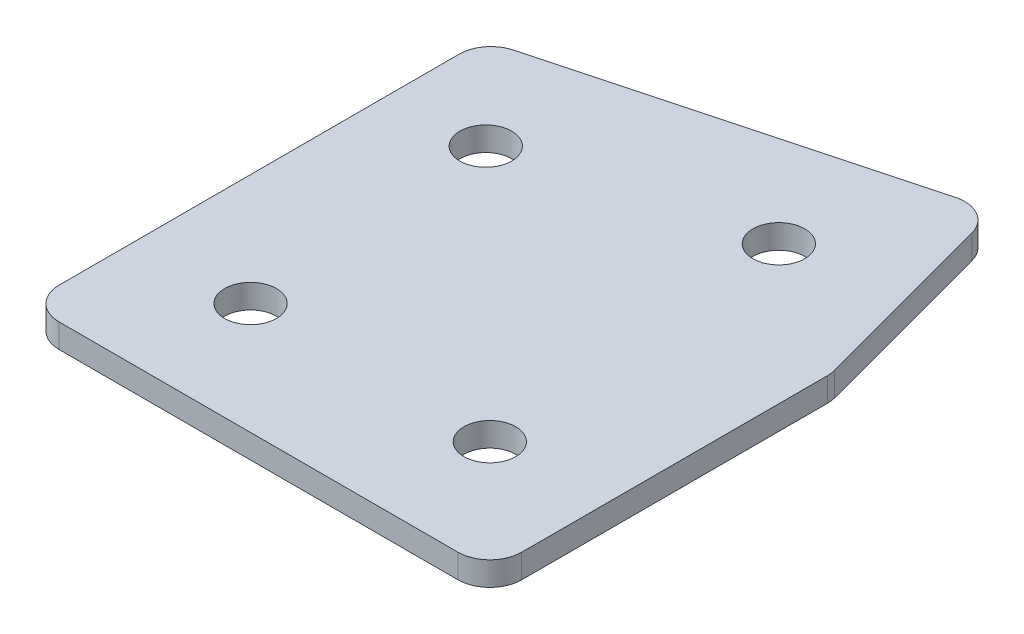
ISO-10303-21;
HEADER;
FILE_DESCRIPTION(('STEP AP214'),'2;1');
FILE_NAME('part.step','',(''),(''),'','','');
FILE_SCHEMA(('AUTOMOTIVE_DESIGN { 1 0 10303 214 1 1 1 1 }'));
ENDSEC;
DATA;
#1=APPLICATION_CONTEXT('core data for automotive mechanical design processes');
#2=APPLICATION_PROTOCOL_DEFINITION('international standard','automotive_design',2000,#1);
#3=PRODUCT_CONTEXT('',#1,'mechanical');
#4=PRODUCT('Part','Part','',(#3));
#5=PRODUCT_RELATED_PRODUCT_CATEGORY('part','',(#4));
#6=PRODUCT_DEFINITION_FORMATION('','',#4);
#7=PRODUCT_DEFINITION_CONTEXT('part definition',#1,'design');
#8=PRODUCT_DEFINITION('design','',#6,#7);
#9=PRODUCT_DEFINITION_SHAPE('','',#8);
#10=(LENGTH_UNIT() NAMED_UNIT(*) SI_UNIT(.MILLI.,.METRE.));
#11=(NAMED_UNIT(*) PLANE_ANGLE_UNIT() SI_UNIT($,.RADIAN.));
#12=(NAMED_UNIT(*) SI_UNIT($,.STERADIAN.) SOLID_ANGLE_UNIT());
#13=UNCERTAINTY_MEASURE_WITH_UNIT(LENGTH_MEASURE(1.E-05),#10,'distance_accuracy_value','');
#14=(GEOMETRIC_REPRESENTATION_CONTEXT(3) GLOBAL_UNCERTAINTY_ASSIGNED_CONTEXT((#13)) GLOBAL_UNIT_ASSIGNED_CONTEXT((#10,
#11,#12)) REPRESENTATION_CONTEXT('',''));
#15=CARTESIAN_POINT('',(0.,0.,0.));
#16=DIRECTION('',(0.,0.,1.));
#17=DIRECTION('',(1.,0.,0.));
#18=AXIS2_PLACEMENT_3D('',#15,#16,#17);
#19=CARTESIAN_POINT('',(-69.5103838122176,1.52470932668439,9.61279682901672));
#20=DIRECTION('',(0.,1.,0.));
#21=DIRECTION('',(0.,0.,1.));
#22=AXIS2_PLACEMENT_3D('',#19,#20,#21);
#23=PLANE('',#22);
#24=CARTESIAN_POINT('',(6.07548635668534,1.52470932668439,9.61279682901672));
#25=DIRECTION('',(0.,1.,0.));
#26=DIRECTION('',(0.,0.,1.));
#27=AXIS2_PLACEMENT_3D('',#24,#25,#26);
#28=CIRCLE('',#27,1.625);
#29=CARTESIAN_POINT('',(6.07548635668534,1.52470932668439,11.2377968290167));
#30=VERTEX_POINT('',#29);
#31=EDGE_CURVE('E201',#30,#30,#28,.T.);
#32=ORIENTED_EDGE('',*,*,#31,.T.);
#33=EDGE_LOOP('',(#32));
#34=FACE_BOUND('',#33,.T.);
#35=CARTESIAN_POINT('',(4.38989982124843,1.52470932668439,-10.1887244910011));
#36=DIRECTION('',(0.,1.,0.));
#37=DIRECTION('',(0.,0.,1.));
#38=AXIS2_PLACEMENT_3D('',#35,#36,#37);
#39=CIRCLE('',#38,1.625);
#40=CARTESIAN_POINT('',(4.38989982124843,1.52470932668439,-8.56372449100109));
#41=VERTEX_POINT('',#40);
#42=EDGE_CURVE('E195',#41,#41,#39,.T.);
#43=ORIENTED_EDGE('',*,*,#42,.T.);
#44=EDGE_LOOP('',(#43));
#45=FACE_BOUND('',#44,.T.);
#46=CARTESIAN_POINT('',(-10.0989875730876,1.52470932668439,-6.30643881446327));
#47=DIRECTION('',(0.,1.,0.));
#48=DIRECTION('',(0.,0.,1.));
#49=AXIS2_PLACEMENT_3D('',#46,#47,#48);
#50=CIRCLE('',#49,1.625);
#51=CARTESIAN_POINT('',(-10.0989875730876,1.52470932668439,-4.68143881446327));
#52=VERTEX_POINT('',#51);
#53=EDGE_CURVE('E189',#52,#52,#50,.T.);
#54=ORIENTED_EDGE('',*,*,#53,.T.);
#55=EDGE_LOOP('',(#54));
#56=FACE_BOUND('',#55,.T.);
#57=CARTESIAN_POINT('',(-8.92451364331465,1.52470932668439,9.61279682901672));
#58=DIRECTION('',(0.,1.,0.));
#59=DIRECTION('',(0.,0.,1.));
#60=AXIS2_PLACEMENT_3D('',#57,#58,#59);
#61=CIRCLE('',#60,1.625);
#62=CARTESIAN_POINT('',(-8.92451364331465,1.52470932668439,11.2377968290167));
#63=VERTEX_POINT('',#62);
#64=EDGE_CURVE('E115',#63,#63,#61,.T.);
#65=ORIENTED_EDGE('',*,*,#64,.T.);
#66=EDGE_LOOP('',(#65));
#67=FACE_BOUND('',#66,.T.);
#68=DIRECTION('',(0.,0.,1.));
#69=VECTOR('',#68,1.);
#70=CARTESIAN_POINT('',(-15.9245136433147,1.52470932668439,-11.9924270713301));
#71=LINE('',#70,#69);
#72=CARTESIAN_POINT('',(-15.9245136433147,1.52470932668439,-10.4577730953722));
#73=VERTEX_POINT('',#72);
#74=CARTESIAN_POINT('',(-15.9245136433146,1.52470932668439,14.6127968290168));
#75=VERTEX_POINT('',#74);
#76=EDGE_CURVE('E182',#73,#75,#71,.T.);
#77=ORIENTED_EDGE('',*,*,#76,.F.);
#78=CARTESIAN_POINT('',(-13.9245136433147,1.52470932668439,-10.4577730953722));
#79=DIRECTION('',(0.,1.,0.));
#80=DIRECTION('',(0.,0.,1.));
#81=AXIS2_PLACEMENT_3D('',#78,#79,#80);
#82=CIRCLE('',#81,2.);
#83=CARTESIAN_POINT('',(-14.4421517335197,1.52470932668439,-12.3896247479503));
#84=VERTEX_POINT('',#83);
#85=EDGE_CURVE('E146',#73,#84,#82,.F.);
#86=ORIENTED_EDGE('',*,*,#85,.T.);
#87=DIRECTION('',(-0.965925826289068,0.,0.258819045102523));
#88=VECTOR('',#87,1.);
#89=CARTESIAN_POINT('',(9.33964728955423,1.52470932668439,-18.7619385907423));
#90=LINE('',#89,#88);
#91=CARTESIAN_POINT('',(7.40779563697609,1.52470932668439,-18.2443005005373));
#92=VERTEX_POINT('',#91);
#93=EDGE_CURVE('E174',#92,#84,#90,.T.);
#94=ORIENTED_EDGE('',*,*,#93,.F.);
#95=CARTESIAN_POINT('',(7.92543372718113,1.52470932668439,-16.3124488479591));
#96=DIRECTION('',(0.,1.,0.));
#97=DIRECTION('',(0.,0.,1.));
#98=AXIS2_PLACEMENT_3D('',#95,#96,#97);
#99=CIRCLE('',#98,2.);
#100=CARTESIAN_POINT('',(9.85728537975927,1.52470932668439,-16.8300869381642));
#101=VERTEX_POINT('',#100);
#102=EDGE_CURVE('E118',#92,#101,#99,.F.);
#103=ORIENTED_EDGE('',*,*,#102,.T.);
#104=DIRECTION('',(-0.258819045102521,0.,-0.965925826289068));
#105=VECTOR('',#104,1.);
#106=CARTESIAN_POINT('',(13.0754863566854,1.52470932668439,-4.8195973833082));
#107=LINE('',#106,#105);
#108=CARTESIAN_POINT('',(13.0073380092635,1.52470932668439,-5.07393047833843));
#109=VERTEX_POINT('',#108);
#110=EDGE_CURVE('E119',#109,#101,#107,.T.);
#111=ORIENTED_EDGE('',*,*,#110,.F.);
#112=CARTESIAN_POINT('',(11.0754863566854,1.52470932668439,-4.55629238813339));
#113=DIRECTION('',(0.,1.,0.));
#114=DIRECTION('',(0.,0.,1.));
#115=AXIS2_PLACEMENT_3D('',#112,#113,#114);
#116=CIRCLE('',#115,2.);
#117=CARTESIAN_POINT('',(13.0754863566854,1.52470932668439,-4.55629238813339));
#118=VERTEX_POINT('',#117);
#119=EDGE_CURVE('E141',#109,#118,#116,.F.);
#120=ORIENTED_EDGE('',*,*,#119,.T.);
#121=DIRECTION('',(0.,0.,-1.));
#122=VECTOR('',#121,1.);
#123=CARTESIAN_POINT('',(13.0754863566853,1.52470932668439,16.6127968290168));
#124=LINE('',#123,#122);
#125=CARTESIAN_POINT('',(13.0754863566853,1.52470932668439,14.6127968290168));
#126=VERTEX_POINT('',#125);
#127=EDGE_CURVE('E123',#126,#118,#124,.T.);
#128=ORIENTED_EDGE('',*,*,#127,.F.);
#129=CARTESIAN_POINT('',(11.0754863566853,1.52470932668439,14.6127968290168));
#130=DIRECTION('',(0.,1.,0.));
#131=DIRECTION('',(0.,0.,1.));
#132=AXIS2_PLACEMENT_3D('',#129,#130,#131);
#133=CIRCLE('',#132,2.);
#134=CARTESIAN_POINT('',(11.0754863566853,1.52470932668439,16.6127968290168));
#135=VERTEX_POINT('',#134);
#136=EDGE_CURVE('E31',#126,#135,#133,.F.);
#137=ORIENTED_EDGE('',*,*,#136,.T.);
#138=DIRECTION('',(1.,0.,0.));
#139=VECTOR('',#138,1.);
#140=CARTESIAN_POINT('',(-15.9245136433146,1.52470932668439,16.6127968290168));
#141=LINE('',#140,#139);
#142=CARTESIAN_POINT('',(-13.9245136433146,1.52470932668439,16.6127968290168));
#143=VERTEX_POINT('',#142);
#144=EDGE_CURVE('E180',#143,#135,#141,.T.);
#145=ORIENTED_EDGE('',*,*,#144,.F.);
#146=CARTESIAN_POINT('',(-13.9245136433146,1.52470932668439,14.6127968290168));
#147=DIRECTION('',(0.,1.,0.));
#148=DIRECTION('',(0.,0.,1.));
#149=AXIS2_PLACEMENT_3D('',#146,#147,#148);
#150=CIRCLE('',#149,2.);
#151=EDGE_CURVE('E144',#143,#75,#150,.F.);
#152=ORIENTED_EDGE('',*,*,#151,.T.);
#153=EDGE_LOOP('',(#77,#86,#94,#103,#111,#120,#128,#137,#145,#152));
#154=FACE_BOUND('',#153,.T.);
#155=ADVANCED_FACE('F16',(#34,#45,#56,#67,#154),#23,.F.);
#156=CARTESIAN_POINT('',(9.33964728955423,1.52470932668439,-18.7619385907423));
#157=DIRECTION('',(-0.258819045102523,0.,-0.965925826289068));
#158=DIRECTION('',(-0.965925826289068,0.,0.258819045102523));
#159=AXIS2_PLACEMENT_3D('',#156,#157,#158);
#160=PLANE('',#159);
#161=ORIENTED_EDGE('',*,*,#93,.T.);
#162=DIRECTION('',(0.,1.,0.));
#163=VECTOR('',#162,1.);
#164=CARTESIAN_POINT('',(-14.4421517335197,1.52470932668439,-12.3896247479503));
#165=LINE('',#164,#163);
#166=CARTESIAN_POINT('',(-14.4421517335197,3.02470932668439,-12.3896247479503));
#167=VERTEX_POINT('',#166);
#168=EDGE_CURVE('E105',#84,#167,#165,.T.);
#169=ORIENTED_EDGE('',*,*,#168,.T.);
#170=DIRECTION('',(-0.965925826289068,0.,0.258819045102523));
#171=VECTOR('',#170,1.);
#172=CARTESIAN_POINT('',(9.33964728955423,3.02470932668439,-18.7619385907423));
#173=LINE('',#172,#171);
#174=CARTESIAN_POINT('',(7.40779563697609,3.02470932668439,-18.2443005005373));
#175=VERTEX_POINT('',#174);
#176=EDGE_CURVE('E97',#175,#167,#173,.T.);
#177=ORIENTED_EDGE('',*,*,#176,.F.);
#178=DIRECTION('',(0.,1.,0.));
#179=VECTOR('',#178,1.);
#180=CARTESIAN_POINT('',(7.40779563697609,1.52470932668439,-18.2443005005373));
#181=LINE('',#180,#179);
#182=EDGE_CURVE('E111',#175,#92,#181,.F.);
#183=ORIENTED_EDGE('',*,*,#182,.T.);
#184=EDGE_LOOP('',(#161,#169,#177,#183));
#185=FACE_BOUND('',#184,.T.);
#186=ADVANCED_FACE('F110',(#185),#160,.T.);
#187=CARTESIAN_POINT('',(13.0754863566854,1.52470932668439,-4.8195973833082));
#188=DIRECTION('',(0.965925826289068,0.,-0.258819045102521));
#189=DIRECTION('',(-0.258819045102521,0.,-0.965925826289068));
#190=AXIS2_PLACEMENT_3D('',#187,#188,#189);
#191=PLANE('',#190);
#192=DIRECTION('',(-0.258819045102521,0.,-0.965925826289068));
#193=VECTOR('',#192,1.);
#194=CARTESIAN_POINT('',(13.0754863566854,3.02470932668439,-4.8195973833082));
#195=LINE('',#194,#193);
#196=CARTESIAN_POINT('',(13.0073380092635,3.02470932668439,-5.07393047833843));
#197=VERTEX_POINT('',#196);
#198=CARTESIAN_POINT('',(9.85728537975927,3.02470932668439,-16.8300869381642));
#199=VERTEX_POINT('',#198);
#200=EDGE_CURVE('E99',#197,#199,#195,.T.);
#201=ORIENTED_EDGE('',*,*,#200,.F.);
#202=DIRECTION('',(0.,1.,0.));
#203=VECTOR('',#202,1.);
#204=CARTESIAN_POINT('',(13.0073380092635,1.52470932668439,-5.07393047833843));
#205=LINE('',#204,#203);
#206=EDGE_CURVE('E10',#197,#109,#205,.F.);
#207=ORIENTED_EDGE('',*,*,#206,.T.);
#208=ORIENTED_EDGE('',*,*,#110,.T.);
#209=DIRECTION('',(0.,1.,0.));
#210=VECTOR('',#209,1.);
#211=CARTESIAN_POINT('',(9.85728537975927,1.52470932668439,-16.8300869381642));
#212=LINE('',#211,#210);
#213=EDGE_CURVE('E24',#101,#199,#212,.T.);
#214=ORIENTED_EDGE('',*,*,#213,.T.);
#215=EDGE_LOOP('',(#201,#207,#208,#214));
#216=FACE_BOUND('',#215,.T.);
#217=ADVANCED_FACE('F157',(#216),#191,.T.);
#218=CARTESIAN_POINT('',(13.0754863566853,1.52470932668439,16.6127968290168));
#219=DIRECTION('',(1.,0.,0.));
#220=DIRECTION('',(0.,0.,-1.));
#221=AXIS2_PLACEMENT_3D('',#218,#219,#220);
#222=PLANE('',#221);
#223=DIRECTION('',(0.,0.,-1.));
#224=VECTOR('',#223,1.);
#225=CARTESIAN_POINT('',(13.0754863566853,3.02470932668439,16.6127968290168));
#226=LINE('',#225,#224);
#227=CARTESIAN_POINT('',(13.0754863566853,3.02470932668439,14.6127968290168));
#228=VERTEX_POINT('',#227);
#229=CARTESIAN_POINT('',(13.0754863566854,3.02470932668439,-4.55629238813339));
#230=VERTEX_POINT('',#229);
#231=EDGE_CURVE('E170',#228,#230,#226,.T.);
#232=ORIENTED_EDGE('',*,*,#231,.F.);
#233=DIRECTION('',(0.,1.,0.));
#234=VECTOR('',#233,1.);
#235=CARTESIAN_POINT('',(13.0754863566853,1.52470932668439,14.6127968290168));
#236=LINE('',#235,#234);
#237=EDGE_CURVE('E155',#228,#126,#236,.F.);
#238=ORIENTED_EDGE('',*,*,#237,.T.);
#239=ORIENTED_EDGE('',*,*,#127,.T.);
#240=DIRECTION('',(0.,1.,0.));
#241=VECTOR('',#240,1.);
#242=CARTESIAN_POINT('',(13.0754863566854,1.52470932668439,-4.55629238813339));
#243=LINE('',#242,#241);
#244=EDGE_CURVE('E152',#118,#230,#243,.T.);
#245=ORIENTED_EDGE('',*,*,#244,.T.);
#246=EDGE_LOOP('',(#232,#238,#239,#245));
#247=FACE_BOUND('',#246,.T.);
#248=ADVANCED_FACE('F169',(#247),#222,.T.);
#249=CARTESIAN_POINT('',(-15.9245136433146,1.52470932668439,16.6127968290168));
#250=DIRECTION('',(0.,0.,1.));
#251=DIRECTION('',(1.,0.,0.));
#252=AXIS2_PLACEMENT_3D('',#249,#250,#251);
#253=PLANE('',#252);
#254=DIRECTION('',(1.,0.,0.));
#255=VECTOR('',#254,1.);
#256=CARTESIAN_POINT('',(-15.9245136433146,3.02470932668439,16.6127968290168));
#257=LINE('',#256,#255);
#258=CARTESIAN_POINT('',(-13.9245136433146,3.02470932668439,16.6127968290168));
#259=VERTEX_POINT('',#258);
#260=CARTESIAN_POINT('',(11.0754863566853,3.02470932668439,16.6127968290168));
#261=VERTEX_POINT('',#260);
#262=EDGE_CURVE('E173',#259,#261,#257,.T.);
#263=ORIENTED_EDGE('',*,*,#262,.F.);
#264=DIRECTION('',(0.,1.,0.));
#265=VECTOR('',#264,1.);
#266=CARTESIAN_POINT('',(-13.9245136433146,1.52470932668439,16.6127968290168));
#267=LINE('',#266,#265);
#268=EDGE_CURVE('E38',#259,#143,#267,.F.);
#269=ORIENTED_EDGE('',*,*,#268,.T.);
#270=ORIENTED_EDGE('',*,*,#144,.T.);
#271=DIRECTION('',(0.,1.,0.));
#272=VECTOR('',#271,1.);
#273=CARTESIAN_POINT('',(11.0754863566853,1.52470932668439,16.6127968290168));
#274=LINE('',#273,#272);
#275=EDGE_CURVE('E148',#135,#261,#274,.T.);
#276=ORIENTED_EDGE('',*,*,#275,.T.);
#277=EDGE_LOOP('',(#263,#269,#270,#276));
#278=FACE_BOUND('',#277,.T.);
#279=ADVANCED_FACE('F333',(#278),#253,.T.);
#280=CARTESIAN_POINT('',(-15.9245136433147,1.52470932668439,-11.9924270713301));
#281=DIRECTION('',(-1.,0.,0.));
#282=DIRECTION('',(0.,0.,1.));
#283=AXIS2_PLACEMENT_3D('',#280,#281,#282);
#284=PLANE('',#283);
#285=DIRECTION('',(0.,0.,1.));
#286=VECTOR('',#285,1.);
#287=CARTESIAN_POINT('',(-15.9245136433147,3.02470932668439,-11.9924270713301));
#288=LINE('',#287,#286);
#289=CARTESIAN_POINT('',(-15.9245136433147,3.02470932668439,-10.4577730953722));
#290=VERTEX_POINT('',#289);
#291=CARTESIAN_POINT('',(-15.9245136433146,3.02470932668439,14.6127968290168));
#292=VERTEX_POINT('',#291);
#293=EDGE_CURVE('E114',#290,#292,#288,.T.);
#294=ORIENTED_EDGE('',*,*,#293,.F.);
#295=DIRECTION('',(0.,1.,0.));
#296=VECTOR('',#295,1.);
#297=CARTESIAN_POINT('',(-15.9245136433147,1.52470932668439,-10.4577730953722));
#298=LINE('',#297,#296);
#299=EDGE_CURVE('E138',#290,#73,#298,.F.);
#300=ORIENTED_EDGE('',*,*,#299,.T.);
#301=ORIENTED_EDGE('',*,*,#76,.T.);
#302=DIRECTION('',(0.,1.,0.));
#303=VECTOR('',#302,1.);
#304=CARTESIAN_POINT('',(-15.9245136433146,1.52470932668439,14.6127968290168));
#305=LINE('',#304,#303);
#306=EDGE_CURVE('E135',#75,#292,#305,.T.);
#307=ORIENTED_EDGE('',*,*,#306,.T.);
#308=EDGE_LOOP('',(#294,#300,#301,#307));
#309=FACE_BOUND('',#308,.T.);
#310=ADVANCED_FACE('F223',(#309),#284,.T.);
#311=CARTESIAN_POINT('',(-69.5103838122176,3.02470932668439,9.61279682901672));
#312=DIRECTION('',(0.,1.,0.));
#313=DIRECTION('',(0.,0.,1.));
#314=AXIS2_PLACEMENT_3D('',#311,#312,#313);
#315=PLANE('',#314);
#316=CARTESIAN_POINT('',(6.07548635668534,3.02470932668439,9.61279682901672));
#317=DIRECTION('',(0.,1.,0.));
#318=DIRECTION('',(0.,0.,1.));
#319=AXIS2_PLACEMENT_3D('',#316,#317,#318);
#320=CIRCLE('',#319,1.625);
#321=CARTESIAN_POINT('',(6.07548635668534,3.02470932668439,11.2377968290167));
#322=VERTEX_POINT('',#321);
#323=EDGE_CURVE('E204',#322,#322,#320,.T.);
#324=ORIENTED_EDGE('',*,*,#323,.F.);
#325=EDGE_LOOP('',(#324));
#326=FACE_BOUND('',#325,.T.);
#327=CARTESIAN_POINT('',(4.38989982124843,3.02470932668439,-10.1887244910011));
#328=DIRECTION('',(0.,1.,0.));
#329=DIRECTION('',(0.,0.,1.));
#330=AXIS2_PLACEMENT_3D('',#327,#328,#329);
#331=CIRCLE('',#330,1.625);
#332=CARTESIAN_POINT('',(4.38989982124843,3.02470932668439,-8.56372449100109));
#333=VERTEX_POINT('',#332);
#334=EDGE_CURVE('E198',#333,#333,#331,.T.);
#335=ORIENTED_EDGE('',*,*,#334,.F.);
#336=EDGE_LOOP('',(#335));
#337=FACE_BOUND('',#336,.T.);
#338=CARTESIAN_POINT('',(-10.0989875730876,3.02470932668439,-6.30643881446327));
#339=DIRECTION('',(0.,1.,0.));
#340=DIRECTION('',(0.,0.,1.));
#341=AXIS2_PLACEMENT_3D('',#338,#339,#340);
#342=CIRCLE('',#341,1.625);
#343=CARTESIAN_POINT('',(-10.0989875730876,3.02470932668439,-4.68143881446327));
#344=VERTEX_POINT('',#343);
#345=EDGE_CURVE('E192',#344,#344,#342,.T.);
#346=ORIENTED_EDGE('',*,*,#345,.F.);
#347=EDGE_LOOP('',(#346));
#348=FACE_BOUND('',#347,.T.);
#349=CARTESIAN_POINT('',(-8.92451364331465,3.02470932668439,9.61279682901672));
#350=DIRECTION('',(0.,1.,0.));
#351=DIRECTION('',(0.,0.,1.));
#352=AXIS2_PLACEMENT_3D('',#349,#350,#351);
#353=CIRCLE('',#352,1.625);
#354=CARTESIAN_POINT('',(-8.92451364331465,3.02470932668439,11.2377968290167));
#355=VERTEX_POINT('',#354);
#356=EDGE_CURVE('E186',#355,#355,#353,.T.);
#357=ORIENTED_EDGE('',*,*,#356,.F.);
#358=EDGE_LOOP('',(#357));
#359=FACE_BOUND('',#358,.T.);
#360=ORIENTED_EDGE('',*,*,#176,.T.);
#361=CARTESIAN_POINT('',(-13.9245136433147,3.02470932668439,-10.4577730953722));
#362=DIRECTION('',(0.,1.,0.));
#363=DIRECTION('',(0.,0.,1.));
#364=AXIS2_PLACEMENT_3D('',#361,#362,#363);
#365=CIRCLE('',#364,2.);
#366=EDGE_CURVE('E133',#167,#290,#365,.T.);
#367=ORIENTED_EDGE('',*,*,#366,.T.);
#368=ORIENTED_EDGE('',*,*,#293,.T.);
#369=CARTESIAN_POINT('',(-13.9245136433146,3.02470932668439,14.6127968290168));
#370=DIRECTION('',(0.,1.,0.));
#371=DIRECTION('',(0.,0.,1.));
#372=AXIS2_PLACEMENT_3D('',#369,#370,#371);
#373=CIRCLE('',#372,2.);
#374=EDGE_CURVE('E131',#292,#259,#373,.T.);
#375=ORIENTED_EDGE('',*,*,#374,.T.);
#376=ORIENTED_EDGE('',*,*,#262,.T.);
#377=CARTESIAN_POINT('',(11.0754863566853,3.02470932668439,14.6127968290168));
#378=DIRECTION('',(0.,1.,0.));
#379=DIRECTION('',(0.,0.,1.));
#380=AXIS2_PLACEMENT_3D('',#377,#378,#379);
#381=CIRCLE('',#380,2.);
#382=EDGE_CURVE('E129',#261,#228,#381,.T.);
#383=ORIENTED_EDGE('',*,*,#382,.T.);
#384=ORIENTED_EDGE('',*,*,#231,.T.);
#385=CARTESIAN_POINT('',(11.0754863566854,3.02470932668439,-4.55629238813339));
#386=DIRECTION('',(0.,1.,0.));
#387=DIRECTION('',(0.,0.,1.));
#388=AXIS2_PLACEMENT_3D('',#385,#386,#387);
#389=CIRCLE('',#388,2.);
#390=EDGE_CURVE('E104',#230,#197,#389,.T.);
#391=ORIENTED_EDGE('',*,*,#390,.T.);
#392=ORIENTED_EDGE('',*,*,#200,.T.);
#393=CARTESIAN_POINT('',(7.92543372718113,3.02470932668439,-16.3124488479591));
#394=DIRECTION('',(0.,1.,0.));
#395=DIRECTION('',(0.,0.,1.));
#396=AXIS2_PLACEMENT_3D('',#393,#394,#395);
#397=CIRCLE('',#396,2.);
#398=EDGE_CURVE('E94',#199,#175,#397,.T.);
#399=ORIENTED_EDGE('',*,*,#398,.T.);
#400=EDGE_LOOP('',(#360,#367,#368,#375,#376,#383,#384,#391,#392,#399));
#401=FACE_BOUND('',#400,.T.);
#402=ADVANCED_FACE('F96',(#326,#337,#348,#359,#401),#315,.T.);
#403=CARTESIAN_POINT('',(-8.92451364331465,1.52470932668439,9.61279682901672));
#404=DIRECTION('',(0.,1.,0.));
#405=DIRECTION('',(0.,0.,1.));
#406=AXIS2_PLACEMENT_3D('',#403,#404,#405);
#407=CYLINDRICAL_SURFACE('',#406,1.625);
#408=ORIENTED_EDGE('',*,*,#64,.F.);
#409=EDGE_LOOP('',(#408));
#410=FACE_BOUND('',#409,.T.);
#411=ORIENTED_EDGE('',*,*,#356,.T.);
#412=EDGE_LOOP('',(#411));
#413=FACE_BOUND('',#412,.T.);
#414=ADVANCED_FACE('F222',(#410,#413),#407,.F.);
#415=CARTESIAN_POINT('',(-10.0989875730876,1.52470932668439,-6.30643881446327));
#416=DIRECTION('',(0.,1.,0.));
#417=DIRECTION('',(0.,0.,1.));
#418=AXIS2_PLACEMENT_3D('',#415,#416,#417);
#419=CYLINDRICAL_SURFACE('',#418,1.625);
#420=ORIENTED_EDGE('',*,*,#53,.F.);
#421=EDGE_LOOP('',(#420));
#422=FACE_BOUND('',#421,.T.);
#423=ORIENTED_EDGE('',*,*,#345,.T.);
#424=EDGE_LOOP('',(#423));
#425=FACE_BOUND('',#424,.T.);
#426=ADVANCED_FACE('F232',(#422,#425),#419,.F.);
#427=CARTESIAN_POINT('',(4.38989982124843,1.52470932668439,-10.1887244910011));
#428=DIRECTION('',(0.,1.,0.));
#429=DIRECTION('',(0.,0.,1.));
#430=AXIS2_PLACEMENT_3D('',#427,#428,#429);
#431=CYLINDRICAL_SURFACE('',#430,1.625);
#432=ORIENTED_EDGE('',*,*,#42,.F.);
#433=EDGE_LOOP('',(#432));
#434=FACE_BOUND('',#433,.T.);
#435=ORIENTED_EDGE('',*,*,#334,.T.);
#436=EDGE_LOOP('',(#435));
#437=FACE_BOUND('',#436,.T.);
#438=ADVANCED_FACE('F216',(#434,#437),#431,.F.);
#439=CARTESIAN_POINT('',(6.07548635668534,1.52470932668439,9.61279682901672));
#440=DIRECTION('',(0.,1.,0.));
#441=DIRECTION('',(0.,0.,1.));
#442=AXIS2_PLACEMENT_3D('',#439,#440,#441);
#443=CYLINDRICAL_SURFACE('',#442,1.625);
#444=ORIENTED_EDGE('',*,*,#31,.F.);
#445=EDGE_LOOP('',(#444));
#446=FACE_BOUND('',#445,.T.);
#447=ORIENTED_EDGE('',*,*,#323,.T.);
#448=EDGE_LOOP('',(#447));
#449=FACE_BOUND('',#448,.T.);
#450=ADVANCED_FACE('F212',(#446,#449),#443,.F.);
#451=CARTESIAN_POINT('',(-13.9245136433147,1.52470932668439,-10.4577730953722));
#452=DIRECTION('',(0.,1.,0.));
#453=DIRECTION('',(0.,0.,1.));
#454=AXIS2_PLACEMENT_3D('',#451,#452,#453);
#455=CYLINDRICAL_SURFACE('',#454,2.);
#456=ORIENTED_EDGE('',*,*,#85,.F.);
#457=ORIENTED_EDGE('',*,*,#299,.F.);
#458=ORIENTED_EDGE('',*,*,#366,.F.);
#459=ORIENTED_EDGE('',*,*,#168,.F.);
#460=EDGE_LOOP('',(#456,#457,#458,#459));
#461=FACE_BOUND('',#460,.T.);
#462=ADVANCED_FACE('F215',(#461),#455,.T.);
#463=CARTESIAN_POINT('',(-13.9245136433146,1.52470932668439,14.6127968290168));
#464=DIRECTION('',(0.,1.,0.));
#465=DIRECTION('',(0.,0.,1.));
#466=AXIS2_PLACEMENT_3D('',#463,#464,#465);
#467=CYLINDRICAL_SURFACE('',#466,2.);
#468=ORIENTED_EDGE('',*,*,#151,.F.);
#469=ORIENTED_EDGE('',*,*,#268,.F.);
#470=ORIENTED_EDGE('',*,*,#374,.F.);
#471=ORIENTED_EDGE('',*,*,#306,.F.);
#472=EDGE_LOOP('',(#468,#469,#470,#471));
#473=FACE_BOUND('',#472,.T.);
#474=ADVANCED_FACE('F252',(#473),#467,.T.);
#475=CARTESIAN_POINT('',(11.0754863566853,1.52470932668439,14.6127968290168));
#476=DIRECTION('',(0.,1.,0.));
#477=DIRECTION('',(0.,0.,1.));
#478=AXIS2_PLACEMENT_3D('',#475,#476,#477);
#479=CYLINDRICAL_SURFACE('',#478,2.);
#480=ORIENTED_EDGE('',*,*,#136,.F.);
#481=ORIENTED_EDGE('',*,*,#237,.F.);
#482=ORIENTED_EDGE('',*,*,#382,.F.);
#483=ORIENTED_EDGE('',*,*,#275,.F.);
#484=EDGE_LOOP('',(#480,#481,#482,#483));
#485=FACE_BOUND('',#484,.T.);
#486=ADVANCED_FACE('F256',(#485),#479,.T.);
#487=CARTESIAN_POINT('',(11.0754863566854,1.52470932668439,-4.55629238813339));
#488=DIRECTION('',(0.,1.,0.));
#489=DIRECTION('',(0.,0.,1.));
#490=AXIS2_PLACEMENT_3D('',#487,#488,#489);
#491=CYLINDRICAL_SURFACE('',#490,2.);
#492=ORIENTED_EDGE('',*,*,#119,.F.);
#493=ORIENTED_EDGE('',*,*,#206,.F.);
#494=ORIENTED_EDGE('',*,*,#390,.F.);
#495=ORIENTED_EDGE('',*,*,#244,.F.);
#496=EDGE_LOOP('',(#492,#493,#494,#495));
#497=FACE_BOUND('',#496,.T.);
#498=ADVANCED_FACE('F165',(#497),#491,.T.);
#499=CARTESIAN_POINT('',(7.92543372718113,1.52470932668439,-16.3124488479591));
#500=DIRECTION('',(0.,1.,0.));
#501=DIRECTION('',(0.,0.,1.));
#502=AXIS2_PLACEMENT_3D('',#499,#500,#501);
#503=CYLINDRICAL_SURFACE('',#502,2.);
#504=ORIENTED_EDGE('',*,*,#102,.F.);
#505=ORIENTED_EDGE('',*,*,#182,.F.);
#506=ORIENTED_EDGE('',*,*,#398,.F.);
#507=ORIENTED_EDGE('',*,*,#213,.F.);
#508=EDGE_LOOP('',(#504,#505,#506,#507));
#509=FACE_BOUND('',#508,.T.);
#510=ADVANCED_FACE('F18',(#509),#503,.T.);
#511=CLOSED_SHELL('',(#155,#186,#217,#248,#279,#310,#402,#414,#426,#438,#450,#462,#474,#486,
#498,#510));
#512=MANIFOLD_SOLID_BREP('B1',#511);
#513=ADVANCED_BREP_SHAPE_REPRESENTATION('',(#18,#512),#14);
#514=SHAPE_DEFINITION_REPRESENTATION(#9,#513);
ENDSEC;
END-ISO-10303-21;
